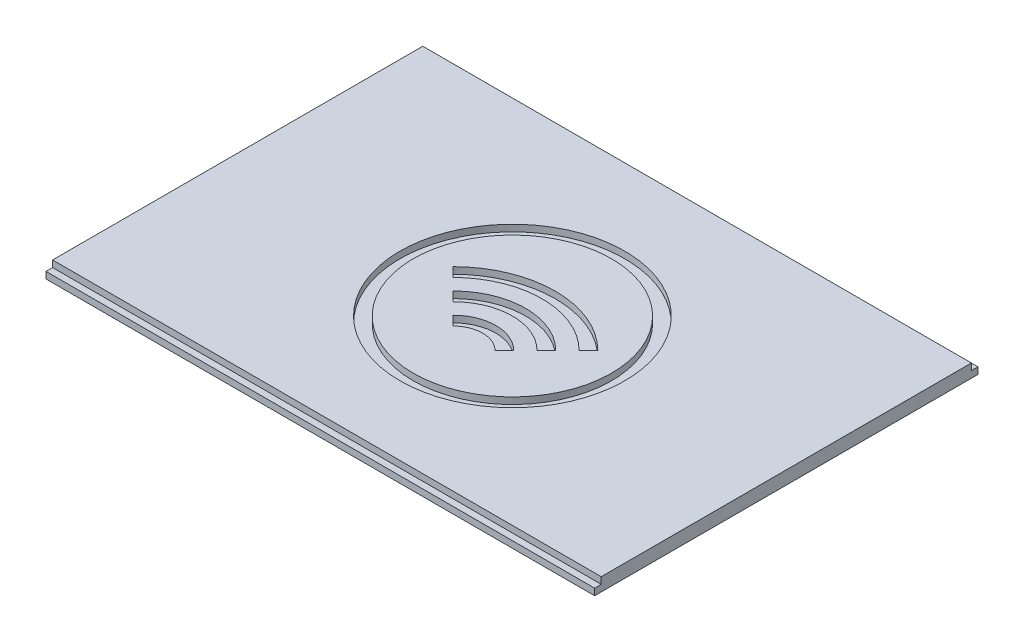
ISO-10303-21;
HEADER;
FILE_DESCRIPTION(('STEP AP214'),'2;1');
FILE_NAME('part.step','',(''),(''),'','','');
FILE_SCHEMA(('AUTOMOTIVE_DESIGN { 1 0 10303 214 1 1 1 1 }'));
ENDSEC;
DATA;
#1=APPLICATION_CONTEXT('core data for automotive mechanical design processes');
#2=APPLICATION_PROTOCOL_DEFINITION('international standard','automotive_design',2000,#1);
#3=PRODUCT_CONTEXT('',#1,'mechanical');
#4=PRODUCT('Part','Part','',(#3));
#5=PRODUCT_RELATED_PRODUCT_CATEGORY('part','',(#4));
#6=PRODUCT_DEFINITION_FORMATION('','',#4);
#7=PRODUCT_DEFINITION_CONTEXT('part definition',#1,'design');
#8=PRODUCT_DEFINITION('design','',#6,#7);
#9=PRODUCT_DEFINITION_SHAPE('','',#8);
#10=(LENGTH_UNIT() NAMED_UNIT(*) SI_UNIT(.MILLI.,.METRE.));
#11=(NAMED_UNIT(*) PLANE_ANGLE_UNIT() SI_UNIT($,.RADIAN.));
#12=(NAMED_UNIT(*) SI_UNIT($,.STERADIAN.) SOLID_ANGLE_UNIT());
#13=UNCERTAINTY_MEASURE_WITH_UNIT(LENGTH_MEASURE(1.E-05),#10,'distance_accuracy_value','');
#14=(GEOMETRIC_REPRESENTATION_CONTEXT(3) GLOBAL_UNCERTAINTY_ASSIGNED_CONTEXT((#13)) GLOBAL_UNIT_ASSIGNED_CONTEXT((#10,
#11,#12)) REPRESENTATION_CONTEXT('',''));
#15=CARTESIAN_POINT('',(0.,0.,0.));
#16=DIRECTION('',(0.,0.,1.));
#17=DIRECTION('',(1.,0.,0.));
#18=AXIS2_PLACEMENT_3D('',#15,#16,#17);
#19=CARTESIAN_POINT('',(0.,2.,0.));
#20=DIRECTION('',(0.,-1.,0.));
#21=DIRECTION('',(0.,0.,-1.));
#22=AXIS2_PLACEMENT_3D('',#19,#20,#21);
#23=PLANE('',#22);
#24=DIRECTION('',(-0.707106781186548,0.,-0.707106781186548));
#25=VECTOR('',#24,1.);
#26=CARTESIAN_POINT('',(30.7801669810002,2.,-30.7801669810002));
#27=LINE('',#26,#25);
#28=CARTESIAN_POINT('',(35.7558638216073,2.,-25.8044701403931));
#29=VERTEX_POINT('',#28);
#30=CARTESIAN_POINT('',(34.3416502592342,2.,-27.2186837027662));
#31=VERTEX_POINT('',#30);
#32=EDGE_CURVE('E149',#29,#31,#27,.T.);
#33=ORIENTED_EDGE('',*,*,#32,.T.);
#34=CARTESIAN_POINT('',(42.1198248522862,2.,-19.4405091097142));
#35=DIRECTION('',(0.,1.,0.));
#36=DIRECTION('',(0.,0.,1.));
#37=AXIS2_PLACEMENT_3D('',#34,#35,#36);
#38=CIRCLE('',#37,11.);
#39=CARTESIAN_POINT('',(49.8979994453382,2.,-27.2186837027662));
#40=VERTEX_POINT('',#39);
#41=EDGE_CURVE('E305',#31,#40,#38,.F.);
#42=ORIENTED_EDGE('',*,*,#41,.T.);
#43=DIRECTION('',(0.707106781186547,0.,-0.707106781186548));
#44=VECTOR('',#43,1.);
#45=CARTESIAN_POINT('',(11.3396578712861,2.,11.339657871286));
#46=LINE('',#45,#44);
#47=CARTESIAN_POINT('',(48.4837858829651,2.,-25.8044701403931));
#48=VERTEX_POINT('',#47);
#49=EDGE_CURVE('E318',#48,#40,#46,.T.);
#50=ORIENTED_EDGE('',*,*,#49,.F.);
#51=CARTESIAN_POINT('',(42.1198248522862,2.,-19.4405091097142));
#52=DIRECTION('',(0.,1.,0.));
#53=DIRECTION('',(0.,0.,1.));
#54=AXIS2_PLACEMENT_3D('',#51,#52,#53);
#55=CIRCLE('',#54,8.99999999999999);
#56=EDGE_CURVE('E315',#29,#48,#55,.F.);
#57=ORIENTED_EDGE('',*,*,#56,.F.);
#58=EDGE_LOOP('',(#33,#42,#50,#57));
#59=FACE_BOUND('',#58,.T.);
#60=CARTESIAN_POINT('',(42.1198248522862,2.,-28.4405091097142));
#61=DIRECTION('',(0.,1.,0.));
#62=DIRECTION('',(0.,0.,1.));
#63=AXIS2_PLACEMENT_3D('',#60,#61,#62);
#64=CIRCLE('',#63,15.);
#65=CARTESIAN_POINT('',(42.1198248522862,2.,-13.4405091097142));
#66=VERTEX_POINT('',#65);
#67=EDGE_CURVE('E355',#66,#66,#64,.T.);
#68=ORIENTED_EDGE('',*,*,#67,.T.);
#69=EDGE_LOOP('',(#68));
#70=FACE_BOUND('',#69,.T.);
#71=CARTESIAN_POINT('',(42.1198248522862,2.,-19.4405091097142));
#72=DIRECTION('',(0.,1.,0.));
#73=DIRECTION('',(0.,0.,1.));
#74=AXIS2_PLACEMENT_3D('',#71,#72,#73);
#75=CIRCLE('',#74,15.5);
#76=CARTESIAN_POINT('',(31.1596697438947,2.,-30.4006642181057));
#77=VERTEX_POINT('',#76);
#78=CARTESIAN_POINT('',(53.0799799606777,2.,-30.4006642181057));
#79=VERTEX_POINT('',#78);
#80=EDGE_CURVE('E325',#77,#79,#75,.F.);
#81=ORIENTED_EDGE('',*,*,#80,.T.);
#82=DIRECTION('',(0.707106781186548,0.,-0.707106781186548));
#83=VECTOR('',#82,1.);
#84=CARTESIAN_POINT('',(11.339657871286,2.,11.339657871286));
#85=LINE('',#84,#83);
#86=CARTESIAN_POINT('',(51.6657663983046,2.,-28.9864506557326));
#87=VERTEX_POINT('',#86);
#88=EDGE_CURVE('E334',#87,#79,#85,.T.);
#89=ORIENTED_EDGE('',*,*,#88,.F.);
#90=CARTESIAN_POINT('',(42.1198248522862,2.,-19.4405091097142));
#91=DIRECTION('',(0.,1.,0.));
#92=DIRECTION('',(0.,0.,1.));
#93=AXIS2_PLACEMENT_3D('',#90,#91,#92);
#94=CIRCLE('',#93,13.5);
#95=CARTESIAN_POINT('',(32.5738833062678,2.,-28.9864506557326));
#96=VERTEX_POINT('',#95);
#97=EDGE_CURVE('E348',#96,#87,#94,.F.);
#98=ORIENTED_EDGE('',*,*,#97,.F.);
#99=DIRECTION('',(-0.707106781186548,0.,-0.707106781186548));
#100=VECTOR('',#99,1.);
#101=CARTESIAN_POINT('',(30.7801669810002,2.,-30.7801669810002));
#102=LINE('',#101,#100);
#103=EDGE_CURVE('E345',#96,#77,#102,.T.);
#104=ORIENTED_EDGE('',*,*,#103,.T.);
#105=EDGE_LOOP('',(#81,#89,#98,#104));
#106=FACE_BOUND('',#105,.T.);
#107=DIRECTION('',(-0.707106781186548,0.,-0.707106781186548));
#108=VECTOR('',#107,1.);
#109=CARTESIAN_POINT('',(30.7801669810002,2.,-30.7801669810002));
#110=LINE('',#109,#108);
#111=CARTESIAN_POINT('',(38.9378443369467,2.,-22.6224896250536));
#112=VERTEX_POINT('',#111);
#113=CARTESIAN_POINT('',(37.5236307745736,2.,-24.0367031874267));
#114=VERTEX_POINT('',#113);
#115=EDGE_CURVE('E141',#112,#114,#110,.T.);
#116=ORIENTED_EDGE('',*,*,#115,.T.);
#117=CARTESIAN_POINT('',(42.1198248522862,2.,-19.4405091097142));
#118=DIRECTION('',(0.,1.,0.));
#119=DIRECTION('',(0.,0.,1.));
#120=AXIS2_PLACEMENT_3D('',#117,#118,#119);
#121=CIRCLE('',#120,6.5);
#122=CARTESIAN_POINT('',(46.7160189299987,2.,-24.0367031874267));
#123=VERTEX_POINT('',#122);
#124=EDGE_CURVE('E279',#114,#123,#121,.F.);
#125=ORIENTED_EDGE('',*,*,#124,.T.);
#126=DIRECTION('',(0.707106781186548,0.,-0.707106781186548));
#127=VECTOR('',#126,1.);
#128=CARTESIAN_POINT('',(11.339657871286,2.,11.339657871286));
#129=LINE('',#128,#127);
#130=CARTESIAN_POINT('',(45.3018053676257,2.,-22.6224896250537));
#131=VERTEX_POINT('',#130);
#132=EDGE_CURVE('E291',#131,#123,#129,.T.);
#133=ORIENTED_EDGE('',*,*,#132,.F.);
#134=CARTESIAN_POINT('',(42.1198248522862,2.,-19.4405091097142));
#135=DIRECTION('',(0.,1.,0.));
#136=DIRECTION('',(0.,0.,1.));
#137=AXIS2_PLACEMENT_3D('',#134,#135,#136);
#138=CIRCLE('',#137,4.5);
#139=EDGE_CURVE('E289',#112,#131,#138,.F.);
#140=ORIENTED_EDGE('',*,*,#139,.F.);
#141=EDGE_LOOP('',(#116,#125,#133,#140));
#142=FACE_BOUND('',#141,.T.);
#143=ADVANCED_FACE('F126',(#59,#70,#106,#142),#23,.F.);
#144=CARTESIAN_POINT('',(0.,2.,-58.));
#145=DIRECTION('',(0.,0.,1.));
#146=DIRECTION('',(1.,0.,0.));
#147=AXIS2_PLACEMENT_3D('',#144,#145,#146);
#148=PLANE('',#147);
#149=DIRECTION('',(-1.,0.,0.));
#150=VECTOR('',#149,1.);
#151=CARTESIAN_POINT('',(0.,1.,-58.));
#152=LINE('',#151,#150);
#153=CARTESIAN_POINT('',(83.,1.,-58.));
#154=VERTEX_POINT('',#153);
#155=CARTESIAN_POINT('',(0.,1.,-58.));
#156=VERTEX_POINT('',#155);
#157=EDGE_CURVE('E398',#154,#156,#152,.T.);
#158=ORIENTED_EDGE('',*,*,#157,.F.);
#159=DIRECTION('',(0.,-1.,0.));
#160=VECTOR('',#159,1.);
#161=CARTESIAN_POINT('',(83.,2.,-58.));
#162=LINE('',#161,#160);
#163=CARTESIAN_POINT('',(83.,0.,-58.));
#164=VERTEX_POINT('',#163);
#165=EDGE_CURVE('E426',#154,#164,#162,.T.);
#166=ORIENTED_EDGE('',*,*,#165,.T.);
#167=DIRECTION('',(-1.,0.,0.));
#168=VECTOR('',#167,1.);
#169=CARTESIAN_POINT('',(0.,0.,-58.));
#170=LINE('',#169,#168);
#171=CARTESIAN_POINT('',(0.,0.,-58.));
#172=VERTEX_POINT('',#171);
#173=EDGE_CURVE('E412',#164,#172,#170,.T.);
#174=ORIENTED_EDGE('',*,*,#173,.T.);
#175=DIRECTION('',(0.,-1.,0.));
#176=VECTOR('',#175,1.);
#177=CARTESIAN_POINT('',(0.,2.,-58.));
#178=LINE('',#177,#176);
#179=EDGE_CURVE('E414',#156,#172,#178,.T.);
#180=ORIENTED_EDGE('',*,*,#179,.F.);
#181=EDGE_LOOP('',(#158,#166,#174,#180));
#182=FACE_BOUND('',#181,.T.);
#183=ADVANCED_FACE('F447',(#182),#148,.F.);
#184=CARTESIAN_POINT('',(0.,2.,0.));
#185=DIRECTION('',(1.,0.,0.));
#186=DIRECTION('',(0.,0.,-1.));
#187=AXIS2_PLACEMENT_3D('',#184,#185,#186);
#188=PLANE('',#187);
#189=DIRECTION('',(0.,0.,1.));
#190=VECTOR('',#189,1.);
#191=CARTESIAN_POINT('',(0.,1.,0.));
#192=LINE('',#191,#190);
#193=CARTESIAN_POINT('',(0.,1.,-1.));
#194=VERTEX_POINT('',#193);
#195=CARTESIAN_POINT('',(0.,1.,0.));
#196=VERTEX_POINT('',#195);
#197=EDGE_CURVE('E374',#194,#196,#192,.T.);
#198=ORIENTED_EDGE('',*,*,#197,.F.);
#199=DIRECTION('',(0.,1.,0.));
#200=VECTOR('',#199,1.);
#201=CARTESIAN_POINT('',(0.,1.,-1.));
#202=LINE('',#201,#200);
#203=CARTESIAN_POINT('',(0.,2.,-1.));
#204=VERTEX_POINT('',#203);
#205=EDGE_CURVE('E385',#194,#204,#202,.T.);
#206=ORIENTED_EDGE('',*,*,#205,.T.);
#207=DIRECTION('',(0.,0.,1.));
#208=VECTOR('',#207,1.);
#209=CARTESIAN_POINT('',(0.,2.,0.));
#210=LINE('',#209,#208);
#211=CARTESIAN_POINT('',(0.,2.,-57.));
#212=VERTEX_POINT('',#211);
#213=EDGE_CURVE('E408',#212,#204,#210,.T.);
#214=ORIENTED_EDGE('',*,*,#213,.F.);
#215=DIRECTION('',(0.,1.,0.));
#216=VECTOR('',#215,1.);
#217=CARTESIAN_POINT('',(0.,1.,-57.));
#218=LINE('',#217,#216);
#219=CARTESIAN_POINT('',(0.,1.,-57.));
#220=VERTEX_POINT('',#219);
#221=EDGE_CURVE('E400',#220,#212,#218,.T.);
#222=ORIENTED_EDGE('',*,*,#221,.F.);
#223=DIRECTION('',(0.,0.,1.));
#224=VECTOR('',#223,1.);
#225=CARTESIAN_POINT('',(0.,1.,-58.));
#226=LINE('',#225,#224);
#227=EDGE_CURVE('E390',#156,#220,#226,.T.);
#228=ORIENTED_EDGE('',*,*,#227,.F.);
#229=ORIENTED_EDGE('',*,*,#179,.T.);
#230=DIRECTION('',(0.,0.,1.));
#231=VECTOR('',#230,1.);
#232=CARTESIAN_POINT('',(0.,0.,0.));
#233=LINE('',#232,#231);
#234=CARTESIAN_POINT('',(0.,0.,0.));
#235=VERTEX_POINT('',#234);
#236=EDGE_CURVE('E406',#172,#235,#233,.T.);
#237=ORIENTED_EDGE('',*,*,#236,.T.);
#238=DIRECTION('',(0.,-1.,0.));
#239=VECTOR('',#238,1.);
#240=CARTESIAN_POINT('',(0.,2.,0.));
#241=LINE('',#240,#239);
#242=EDGE_CURVE('E12',#196,#235,#241,.T.);
#243=ORIENTED_EDGE('',*,*,#242,.F.);
#244=EDGE_LOOP('',(#198,#206,#214,#222,#228,#229,#237,#243));
#245=FACE_BOUND('',#244,.T.);
#246=ADVANCED_FACE('F128',(#245),#188,.F.);
#247=CARTESIAN_POINT('',(0.,2.,0.));
#248=DIRECTION('',(0.,0.,-1.));
#249=DIRECTION('',(-1.,0.,0.));
#250=AXIS2_PLACEMENT_3D('',#247,#248,#249);
#251=PLANE('',#250);
#252=DIRECTION('',(0.,-1.,0.));
#253=VECTOR('',#252,1.);
#254=CARTESIAN_POINT('',(83.,2.,0.));
#255=LINE('',#254,#253);
#256=CARTESIAN_POINT('',(83.,1.,0.));
#257=VERTEX_POINT('',#256);
#258=CARTESIAN_POINT('',(83.,0.,0.));
#259=VERTEX_POINT('',#258);
#260=EDGE_CURVE('E134',#257,#259,#255,.T.);
#261=ORIENTED_EDGE('',*,*,#260,.F.);
#262=DIRECTION('',(1.,0.,0.));
#263=VECTOR('',#262,1.);
#264=CARTESIAN_POINT('',(0.,1.,0.));
#265=LINE('',#264,#263);
#266=EDGE_CURVE('E376',#196,#257,#265,.T.);
#267=ORIENTED_EDGE('',*,*,#266,.F.);
#268=ORIENTED_EDGE('',*,*,#242,.T.);
#269=DIRECTION('',(1.,0.,0.));
#270=VECTOR('',#269,1.);
#271=CARTESIAN_POINT('',(0.,0.,0.));
#272=LINE('',#271,#270);
#273=EDGE_CURVE('E417',#235,#259,#272,.T.);
#274=ORIENTED_EDGE('',*,*,#273,.T.);
#275=EDGE_LOOP('',(#261,#267,#268,#274));
#276=FACE_BOUND('',#275,.T.);
#277=ADVANCED_FACE('F439',(#276),#251,.F.);
#278=CARTESIAN_POINT('',(83.,2.,0.));
#279=DIRECTION('',(-1.,0.,0.));
#280=DIRECTION('',(0.,0.,1.));
#281=AXIS2_PLACEMENT_3D('',#278,#279,#280);
#282=PLANE('',#281);
#283=DIRECTION('',(0.,0.,-1.));
#284=VECTOR('',#283,1.);
#285=CARTESIAN_POINT('',(83.,2.,0.));
#286=LINE('',#285,#284);
#287=CARTESIAN_POINT('',(83.,2.,-1.));
#288=VERTEX_POINT('',#287);
#289=CARTESIAN_POINT('',(83.,2.,-57.));
#290=VERTEX_POINT('',#289);
#291=EDGE_CURVE('E411',#288,#290,#286,.T.);
#292=ORIENTED_EDGE('',*,*,#291,.F.);
#293=DIRECTION('',(0.,1.,0.));
#294=VECTOR('',#293,1.);
#295=CARTESIAN_POINT('',(83.,1.,-1.));
#296=LINE('',#295,#294);
#297=CARTESIAN_POINT('',(83.,1.,-1.));
#298=VERTEX_POINT('',#297);
#299=EDGE_CURVE('E383',#298,#288,#296,.T.);
#300=ORIENTED_EDGE('',*,*,#299,.F.);
#301=DIRECTION('',(0.,0.,-1.));
#302=VECTOR('',#301,1.);
#303=CARTESIAN_POINT('',(83.,1.,0.));
#304=LINE('',#303,#302);
#305=EDGE_CURVE('E378',#257,#298,#304,.T.);
#306=ORIENTED_EDGE('',*,*,#305,.F.);
#307=ORIENTED_EDGE('',*,*,#260,.T.);
#308=DIRECTION('',(0.,0.,-1.));
#309=VECTOR('',#308,1.);
#310=CARTESIAN_POINT('',(83.,0.,0.));
#311=LINE('',#310,#309);
#312=EDGE_CURVE('E420',#259,#164,#311,.T.);
#313=ORIENTED_EDGE('',*,*,#312,.T.);
#314=ORIENTED_EDGE('',*,*,#165,.F.);
#315=DIRECTION('',(0.,0.,-1.));
#316=VECTOR('',#315,1.);
#317=CARTESIAN_POINT('',(83.,1.,-58.));
#318=LINE('',#317,#316);
#319=CARTESIAN_POINT('',(83.,1.,-57.));
#320=VERTEX_POINT('',#319);
#321=EDGE_CURVE('E396',#320,#154,#318,.T.);
#322=ORIENTED_EDGE('',*,*,#321,.F.);
#323=DIRECTION('',(0.,1.,0.));
#324=VECTOR('',#323,1.);
#325=CARTESIAN_POINT('',(83.,1.,-57.));
#326=LINE('',#325,#324);
#327=EDGE_CURVE('E403',#320,#290,#326,.T.);
#328=ORIENTED_EDGE('',*,*,#327,.T.);
#329=EDGE_LOOP('',(#292,#300,#306,#307,#313,#314,#322,#328));
#330=FACE_BOUND('',#329,.T.);
#331=ADVANCED_FACE('F431',(#330),#282,.F.);
#332=CARTESIAN_POINT('',(42.1198248522862,2.,-28.4405091097142));
#333=DIRECTION('',(0.,1.,0.));
#334=DIRECTION('',(0.,0.,1.));
#335=AXIS2_PLACEMENT_3D('',#332,#333,#334);
#336=CIRCLE('',#335,17.);
#337=CARTESIAN_POINT('',(42.1198248522862,2.,-11.4405091097142));
#338=VERTEX_POINT('',#337);
#339=EDGE_CURVE('E366',#338,#338,#336,.T.);
#340=ORIENTED_EDGE('',*,*,#339,.F.);
#341=EDGE_LOOP('',(#340));
#342=FACE_BOUND('',#341,.T.);
#343=ORIENTED_EDGE('',*,*,#213,.T.);
#344=DIRECTION('',(-1.,0.,0.));
#345=VECTOR('',#344,1.);
#346=CARTESIAN_POINT('',(0.,2.,-1.));
#347=LINE('',#346,#345);
#348=EDGE_CURVE('E369',#288,#204,#347,.T.);
#349=ORIENTED_EDGE('',*,*,#348,.F.);
#350=ORIENTED_EDGE('',*,*,#291,.T.);
#351=DIRECTION('',(1.,0.,0.));
#352=VECTOR('',#351,1.);
#353=CARTESIAN_POINT('',(0.,2.,-57.));
#354=LINE('',#353,#352);
#355=EDGE_CURVE('E388',#212,#290,#354,.T.);
#356=ORIENTED_EDGE('',*,*,#355,.F.);
#357=EDGE_LOOP('',(#343,#349,#350,#356));
#358=FACE_BOUND('',#357,.T.);
#359=ADVANCED_FACE('F458',(#342,#358),#23,.F.);
#360=CARTESIAN_POINT('',(0.,0.,0.));
#361=DIRECTION('',(0.,-1.,0.));
#362=DIRECTION('',(0.,0.,-1.));
#363=AXIS2_PLACEMENT_3D('',#360,#361,#362);
#364=PLANE('',#363);
#365=ORIENTED_EDGE('',*,*,#236,.F.);
#366=ORIENTED_EDGE('',*,*,#173,.F.);
#367=ORIENTED_EDGE('',*,*,#312,.F.);
#368=ORIENTED_EDGE('',*,*,#273,.F.);
#369=EDGE_LOOP('',(#365,#366,#367,#368));
#370=FACE_BOUND('',#369,.T.);
#371=ADVANCED_FACE('F443',(#370),#364,.T.);
#372=CARTESIAN_POINT('',(0.,1.,-57.));
#373=DIRECTION('',(0.,0.,1.));
#374=DIRECTION('',(1.,0.,0.));
#375=AXIS2_PLACEMENT_3D('',#372,#373,#374);
#376=PLANE('',#375);
#377=ORIENTED_EDGE('',*,*,#355,.T.);
#378=ORIENTED_EDGE('',*,*,#327,.F.);
#379=DIRECTION('',(1.,0.,0.));
#380=VECTOR('',#379,1.);
#381=CARTESIAN_POINT('',(0.,1.,-57.));
#382=LINE('',#381,#380);
#383=EDGE_CURVE('E393',#220,#320,#382,.T.);
#384=ORIENTED_EDGE('',*,*,#383,.F.);
#385=ORIENTED_EDGE('',*,*,#221,.T.);
#386=EDGE_LOOP('',(#377,#378,#384,#385));
#387=FACE_BOUND('',#386,.T.);
#388=ADVANCED_FACE('F454',(#387),#376,.F.);
#389=CARTESIAN_POINT('',(0.,1.,0.));
#390=DIRECTION('',(0.,1.,0.));
#391=DIRECTION('',(0.,0.,1.));
#392=AXIS2_PLACEMENT_3D('',#389,#390,#391);
#393=PLANE('',#392);
#394=ORIENTED_EDGE('',*,*,#227,.T.);
#395=ORIENTED_EDGE('',*,*,#383,.T.);
#396=ORIENTED_EDGE('',*,*,#321,.T.);
#397=ORIENTED_EDGE('',*,*,#157,.T.);
#398=EDGE_LOOP('',(#394,#395,#396,#397));
#399=FACE_BOUND('',#398,.T.);
#400=ADVANCED_FACE('F450',(#399),#393,.T.);
#401=CARTESIAN_POINT('',(0.,1.,-1.));
#402=DIRECTION('',(0.,0.,-1.));
#403=DIRECTION('',(-1.,0.,0.));
#404=AXIS2_PLACEMENT_3D('',#401,#402,#403);
#405=PLANE('',#404);
#406=ORIENTED_EDGE('',*,*,#348,.T.);
#407=ORIENTED_EDGE('',*,*,#205,.F.);
#408=DIRECTION('',(-1.,0.,0.));
#409=VECTOR('',#408,1.);
#410=CARTESIAN_POINT('',(0.,1.,-1.));
#411=LINE('',#410,#409);
#412=EDGE_CURVE('E380',#298,#194,#411,.T.);
#413=ORIENTED_EDGE('',*,*,#412,.F.);
#414=ORIENTED_EDGE('',*,*,#299,.T.);
#415=EDGE_LOOP('',(#406,#407,#413,#414));
#416=FACE_BOUND('',#415,.T.);
#417=ADVANCED_FACE('F464',(#416),#405,.F.);
#418=CARTESIAN_POINT('',(0.,1.,0.));
#419=DIRECTION('',(0.,-1.,0.));
#420=DIRECTION('',(0.,0.,-1.));
#421=AXIS2_PLACEMENT_3D('',#418,#419,#420);
#422=PLANE('',#421);
#423=ORIENTED_EDGE('',*,*,#197,.T.);
#424=ORIENTED_EDGE('',*,*,#266,.T.);
#425=ORIENTED_EDGE('',*,*,#305,.T.);
#426=ORIENTED_EDGE('',*,*,#412,.T.);
#427=EDGE_LOOP('',(#423,#424,#425,#426));
#428=FACE_BOUND('',#427,.T.);
#429=ADVANCED_FACE('F466',(#428),#422,.F.);
#430=CARTESIAN_POINT('',(42.1198248522862,1.,-28.4405091097142));
#431=DIRECTION('',(0.,1.,0.));
#432=DIRECTION('',(0.,0.,1.));
#433=AXIS2_PLACEMENT_3D('',#430,#431,#432);
#434=CYLINDRICAL_SURFACE('',#433,15.);
#435=CARTESIAN_POINT('',(42.1198248522862,1.,-28.4405091097142));
#436=DIRECTION('',(0.,1.,0.));
#437=DIRECTION('',(0.,0.,1.));
#438=AXIS2_PLACEMENT_3D('',#435,#436,#437);
#439=CIRCLE('',#438,15.);
#440=CARTESIAN_POINT('',(42.1198248522862,1.,-13.4405091097142));
#441=VERTEX_POINT('',#440);
#442=EDGE_CURVE('E362',#441,#441,#439,.T.);
#443=ORIENTED_EDGE('',*,*,#442,.T.);
#444=EDGE_LOOP('',(#443));
#445=FACE_BOUND('',#444,.T.);
#446=ORIENTED_EDGE('',*,*,#67,.F.);
#447=EDGE_LOOP('',(#446));
#448=FACE_BOUND('',#447,.T.);
#449=ADVANCED_FACE('F468',(#445,#448),#434,.T.);
#450=CARTESIAN_POINT('',(42.1198248522862,1.,-28.4405091097142));
#451=DIRECTION('',(0.,1.,0.));
#452=DIRECTION('',(0.,0.,1.));
#453=AXIS2_PLACEMENT_3D('',#450,#451,#452);
#454=CYLINDRICAL_SURFACE('',#453,17.);
#455=CARTESIAN_POINT('',(42.1198248522862,1.,-28.4405091097142));
#456=DIRECTION('',(0.,1.,0.));
#457=DIRECTION('',(0.,0.,1.));
#458=AXIS2_PLACEMENT_3D('',#455,#456,#457);
#459=CIRCLE('',#458,17.);
#460=CARTESIAN_POINT('',(42.1198248522862,1.,-11.4405091097142));
#461=VERTEX_POINT('',#460);
#462=EDGE_CURVE('E365',#461,#461,#459,.T.);
#463=ORIENTED_EDGE('',*,*,#462,.F.);
#464=EDGE_LOOP('',(#463));
#465=FACE_BOUND('',#464,.T.);
#466=ORIENTED_EDGE('',*,*,#339,.T.);
#467=EDGE_LOOP('',(#466));
#468=FACE_BOUND('',#467,.T.);
#469=ADVANCED_FACE('F474',(#465,#468),#454,.F.);
#470=CARTESIAN_POINT('',(0.,1.,0.));
#471=DIRECTION('',(0.,1.,0.));
#472=DIRECTION('',(0.,0.,1.));
#473=AXIS2_PLACEMENT_3D('',#470,#471,#472);
#474=PLANE('',#473);
#475=ORIENTED_EDGE('',*,*,#442,.F.);
#476=EDGE_LOOP('',(#475));
#477=FACE_BOUND('',#476,.T.);
#478=ORIENTED_EDGE('',*,*,#462,.T.);
#479=EDGE_LOOP('',(#478));
#480=FACE_BOUND('',#479,.T.);
#481=ADVANCED_FACE('F498',(#477,#480),#474,.T.);
#482=CARTESIAN_POINT('',(42.1198248522862,1.,-19.4405091097142));
#483=DIRECTION('',(0.,1.,0.));
#484=DIRECTION('',(0.,0.,1.));
#485=AXIS2_PLACEMENT_3D('',#482,#483,#484);
#486=CYLINDRICAL_SURFACE('',#485,15.5);
#487=ORIENTED_EDGE('',*,*,#80,.F.);
#488=DIRECTION('',(0.,1.,0.));
#489=VECTOR('',#488,1.);
#490=CARTESIAN_POINT('',(31.1596697438947,1.,-30.4006642181057));
#491=LINE('',#490,#489);
#492=CARTESIAN_POINT('',(31.1596697438947,1.,-30.4006642181057));
#493=VERTEX_POINT('',#492);
#494=EDGE_CURVE('E342',#493,#77,#491,.T.);
#495=ORIENTED_EDGE('',*,*,#494,.F.);
#496=CARTESIAN_POINT('',(42.1198248522862,1.,-19.4405091097142));
#497=DIRECTION('',(0.,1.,0.));
#498=DIRECTION('',(0.,0.,1.));
#499=AXIS2_PLACEMENT_3D('',#496,#497,#498);
#500=CIRCLE('',#499,15.5);
#501=CARTESIAN_POINT('',(53.0799799606777,1.,-30.4006642181057));
#502=VERTEX_POINT('',#501);
#503=EDGE_CURVE('E331',#493,#502,#500,.F.);
#504=ORIENTED_EDGE('',*,*,#503,.T.);
#505=DIRECTION('',(0.,1.,0.));
#506=VECTOR('',#505,1.);
#507=CARTESIAN_POINT('',(53.0799799606777,1.,-30.4006642181057));
#508=LINE('',#507,#506);
#509=EDGE_CURVE('E353',#502,#79,#508,.T.);
#510=ORIENTED_EDGE('',*,*,#509,.T.);
#511=EDGE_LOOP('',(#487,#495,#504,#510));
#512=FACE_BOUND('',#511,.T.);
#513=ADVANCED_FACE('F504',(#512),#486,.F.);
#514=CARTESIAN_POINT('',(11.339657871286,1.,11.339657871286));
#515=DIRECTION('',(0.707106781186547,0.,0.707106781186547));
#516=DIRECTION('',(0.707106781186548,0.,-0.707106781186548));
#517=AXIS2_PLACEMENT_3D('',#514,#515,#516);
#518=PLANE('',#517);
#519=ORIENTED_EDGE('',*,*,#88,.T.);
#520=ORIENTED_EDGE('',*,*,#509,.F.);
#521=DIRECTION('',(0.707106781186548,0.,-0.707106781186548));
#522=VECTOR('',#521,1.);
#523=CARTESIAN_POINT('',(11.339657871286,1.,11.339657871286));
#524=LINE('',#523,#522);
#525=CARTESIAN_POINT('',(51.6657663983046,1.,-28.9864506557326));
#526=VERTEX_POINT('',#525);
#527=EDGE_CURVE('E339',#526,#502,#524,.T.);
#528=ORIENTED_EDGE('',*,*,#527,.F.);
#529=DIRECTION('',(0.,1.,0.));
#530=VECTOR('',#529,1.);
#531=CARTESIAN_POINT('',(51.6657663983046,1.,-28.9864506557326));
#532=LINE('',#531,#530);
#533=EDGE_CURVE('E356',#526,#87,#532,.T.);
#534=ORIENTED_EDGE('',*,*,#533,.T.);
#535=EDGE_LOOP('',(#519,#520,#528,#534));
#536=FACE_BOUND('',#535,.T.);
#537=ADVANCED_FACE('F511',(#536),#518,.F.);
#538=CARTESIAN_POINT('',(42.1198248522862,1.,-19.4405091097142));
#539=DIRECTION('',(0.,1.,0.));
#540=DIRECTION('',(0.,0.,1.));
#541=AXIS2_PLACEMENT_3D('',#538,#539,#540);
#542=CYLINDRICAL_SURFACE('',#541,13.5);
#543=ORIENTED_EDGE('',*,*,#97,.T.);
#544=ORIENTED_EDGE('',*,*,#533,.F.);
#545=CARTESIAN_POINT('',(42.1198248522862,1.,-19.4405091097142));
#546=DIRECTION('',(0.,1.,0.));
#547=DIRECTION('',(0.,0.,1.));
#548=AXIS2_PLACEMENT_3D('',#545,#546,#547);
#549=CIRCLE('',#548,13.5);
#550=CARTESIAN_POINT('',(32.5738833062678,1.,-28.9864506557326));
#551=VERTEX_POINT('',#550);
#552=EDGE_CURVE('E336',#551,#526,#549,.F.);
#553=ORIENTED_EDGE('',*,*,#552,.F.);
#554=DIRECTION('',(0.,1.,0.));
#555=VECTOR('',#554,1.);
#556=CARTESIAN_POINT('',(32.5738833062678,1.,-28.9864506557326));
#557=LINE('',#556,#555);
#558=EDGE_CURVE('E358',#551,#96,#557,.T.);
#559=ORIENTED_EDGE('',*,*,#558,.T.);
#560=EDGE_LOOP('',(#543,#544,#553,#559));
#561=FACE_BOUND('',#560,.T.);
#562=ADVANCED_FACE('F517',(#561),#542,.T.);
#563=CARTESIAN_POINT('',(30.7801669810002,1.,-30.7801669810002));
#564=DIRECTION('',(0.707106781186547,0.,-0.707106781186547));
#565=DIRECTION('',(-0.707106781186548,0.,-0.707106781186548));
#566=AXIS2_PLACEMENT_3D('',#563,#564,#565);
#567=PLANE('',#566);
#568=ORIENTED_EDGE('',*,*,#103,.F.);
#569=ORIENTED_EDGE('',*,*,#558,.F.);
#570=DIRECTION('',(-0.707106781186548,0.,-0.707106781186548));
#571=VECTOR('',#570,1.);
#572=CARTESIAN_POINT('',(30.7801669810002,1.,-30.7801669810002));
#573=LINE('',#572,#571);
#574=EDGE_CURVE('E333',#551,#493,#573,.T.);
#575=ORIENTED_EDGE('',*,*,#574,.T.);
#576=ORIENTED_EDGE('',*,*,#494,.T.);
#577=EDGE_LOOP('',(#568,#569,#575,#576));
#578=FACE_BOUND('',#577,.T.);
#579=ADVANCED_FACE('F513',(#578),#567,.T.);
#580=CARTESIAN_POINT('',(0.,1.,0.));
#581=DIRECTION('',(0.,1.,0.));
#582=DIRECTION('',(0.,0.,1.));
#583=AXIS2_PLACEMENT_3D('',#580,#581,#582);
#584=PLANE('',#583);
#585=ORIENTED_EDGE('',*,*,#503,.F.);
#586=ORIENTED_EDGE('',*,*,#574,.F.);
#587=ORIENTED_EDGE('',*,*,#552,.T.);
#588=ORIENTED_EDGE('',*,*,#527,.T.);
#589=EDGE_LOOP('',(#585,#586,#587,#588));
#590=FACE_BOUND('',#589,.T.);
#591=ADVANCED_FACE('F516',(#590),#584,.T.);
#592=CARTESIAN_POINT('',(30.7801669810002,1.,-30.7801669810002));
#593=DIRECTION('',(0.707106781186547,0.,-0.707106781186547));
#594=DIRECTION('',(-0.707106781186548,0.,-0.707106781186548));
#595=AXIS2_PLACEMENT_3D('',#592,#593,#594);
#596=PLANE('',#595);
#597=ORIENTED_EDGE('',*,*,#32,.F.);
#598=DIRECTION('',(0.,1.,0.));
#599=VECTOR('',#598,1.);
#600=CARTESIAN_POINT('',(35.7558638216073,1.,-25.8044701403931));
#601=LINE('',#600,#599);
#602=CARTESIAN_POINT('',(35.7558638216073,1.,-25.8044701403931));
#603=VERTEX_POINT('',#602);
#604=EDGE_CURVE('E313',#603,#29,#601,.T.);
#605=ORIENTED_EDGE('',*,*,#604,.F.);
#606=DIRECTION('',(-0.707106781186548,0.,-0.707106781186548));
#607=VECTOR('',#606,1.);
#608=CARTESIAN_POINT('',(30.7801669810002,1.,-30.7801669810002));
#609=LINE('',#608,#607);
#610=CARTESIAN_POINT('',(34.3416502592342,1.,-27.2186837027662));
#611=VERTEX_POINT('',#610);
#612=EDGE_CURVE('E301',#603,#611,#609,.T.);
#613=ORIENTED_EDGE('',*,*,#612,.T.);
#614=DIRECTION('',(0.,1.,0.));
#615=VECTOR('',#614,1.);
#616=CARTESIAN_POINT('',(34.3416502592342,1.,-27.2186837027662));
#617=LINE('',#616,#615);
#618=EDGE_CURVE('E323',#611,#31,#617,.T.);
#619=ORIENTED_EDGE('',*,*,#618,.T.);
#620=EDGE_LOOP('',(#597,#605,#613,#619));
#621=FACE_BOUND('',#620,.T.);
#622=ADVANCED_FACE('F527',(#621),#596,.T.);
#623=CARTESIAN_POINT('',(42.1198248522862,1.,-19.4405091097142));
#624=DIRECTION('',(0.,1.,0.));
#625=DIRECTION('',(0.,0.,1.));
#626=AXIS2_PLACEMENT_3D('',#623,#624,#625);
#627=CYLINDRICAL_SURFACE('',#626,11.);
#628=ORIENTED_EDGE('',*,*,#41,.F.);
#629=ORIENTED_EDGE('',*,*,#618,.F.);
#630=CARTESIAN_POINT('',(42.1198248522862,1.,-19.4405091097142));
#631=DIRECTION('',(0.,1.,0.));
#632=DIRECTION('',(0.,0.,1.));
#633=AXIS2_PLACEMENT_3D('',#630,#631,#632);
#634=CIRCLE('',#633,11.);
#635=CARTESIAN_POINT('',(49.8979994453382,1.,-27.2186837027662));
#636=VERTEX_POINT('',#635);
#637=EDGE_CURVE('E311',#611,#636,#634,.F.);
#638=ORIENTED_EDGE('',*,*,#637,.T.);
#639=DIRECTION('',(0.,1.,0.));
#640=VECTOR('',#639,1.);
#641=CARTESIAN_POINT('',(49.8979994453382,1.,-27.2186837027662));
#642=LINE('',#641,#640);
#643=EDGE_CURVE('E326',#636,#40,#642,.T.);
#644=ORIENTED_EDGE('',*,*,#643,.T.);
#645=EDGE_LOOP('',(#628,#629,#638,#644));
#646=FACE_BOUND('',#645,.T.);
#647=ADVANCED_FACE('F531',(#646),#627,.F.);
#648=CARTESIAN_POINT('',(11.3396578712861,1.,11.339657871286));
#649=DIRECTION('',(0.707106781186548,0.,0.707106781186547));
#650=DIRECTION('',(0.707106781186547,0.,-0.707106781186548));
#651=AXIS2_PLACEMENT_3D('',#648,#649,#650);
#652=PLANE('',#651);
#653=ORIENTED_EDGE('',*,*,#49,.T.);
#654=ORIENTED_EDGE('',*,*,#643,.F.);
#655=DIRECTION('',(0.707106781186547,0.,-0.707106781186548));
#656=VECTOR('',#655,1.);
#657=CARTESIAN_POINT('',(11.3396578712861,1.,11.339657871286));
#658=LINE('',#657,#656);
#659=CARTESIAN_POINT('',(48.4837858829651,1.,-25.8044701403931));
#660=VERTEX_POINT('',#659);
#661=EDGE_CURVE('E308',#660,#636,#658,.T.);
#662=ORIENTED_EDGE('',*,*,#661,.F.);
#663=DIRECTION('',(0.,1.,0.));
#664=VECTOR('',#663,1.);
#665=CARTESIAN_POINT('',(48.4837858829651,1.,-25.8044701403931));
#666=LINE('',#665,#664);
#667=EDGE_CURVE('E328',#660,#48,#666,.T.);
#668=ORIENTED_EDGE('',*,*,#667,.T.);
#669=EDGE_LOOP('',(#653,#654,#662,#668));
#670=FACE_BOUND('',#669,.T.);
#671=ADVANCED_FACE('F536',(#670),#652,.F.);
#672=CARTESIAN_POINT('',(42.1198248522862,1.,-19.4405091097142));
#673=DIRECTION('',(0.,1.,0.));
#674=DIRECTION('',(0.,0.,1.));
#675=AXIS2_PLACEMENT_3D('',#672,#673,#674);
#676=CYLINDRICAL_SURFACE('',#675,8.99999999999999);
#677=ORIENTED_EDGE('',*,*,#56,.T.);
#678=ORIENTED_EDGE('',*,*,#667,.F.);
#679=CARTESIAN_POINT('',(42.1198248522862,1.,-19.4405091097142));
#680=DIRECTION('',(0.,1.,0.));
#681=DIRECTION('',(0.,0.,1.));
#682=AXIS2_PLACEMENT_3D('',#679,#680,#681);
#683=CIRCLE('',#682,8.99999999999999);
#684=EDGE_CURVE('E304',#603,#660,#683,.F.);
#685=ORIENTED_EDGE('',*,*,#684,.F.);
#686=ORIENTED_EDGE('',*,*,#604,.T.);
#687=EDGE_LOOP('',(#677,#678,#685,#686));
#688=FACE_BOUND('',#687,.T.);
#689=ADVANCED_FACE('F532',(#688),#676,.T.);
#690=CARTESIAN_POINT('',(0.,1.,0.));
#691=DIRECTION('',(0.,1.,0.));
#692=DIRECTION('',(0.,0.,1.));
#693=AXIS2_PLACEMENT_3D('',#690,#691,#692);
#694=PLANE('',#693);
#695=ORIENTED_EDGE('',*,*,#612,.F.);
#696=ORIENTED_EDGE('',*,*,#684,.T.);
#697=ORIENTED_EDGE('',*,*,#661,.T.);
#698=ORIENTED_EDGE('',*,*,#637,.F.);
#699=EDGE_LOOP('',(#695,#696,#697,#698));
#700=FACE_BOUND('',#699,.T.);
#701=ADVANCED_FACE('F535',(#700),#694,.T.);
#702=CARTESIAN_POINT('',(30.7801669810002,1.,-30.7801669810002));
#703=DIRECTION('',(0.707106781186547,0.,-0.707106781186547));
#704=DIRECTION('',(-0.707106781186548,0.,-0.707106781186548));
#705=AXIS2_PLACEMENT_3D('',#702,#703,#704);
#706=PLANE('',#705);
#707=ORIENTED_EDGE('',*,*,#115,.F.);
#708=DIRECTION('',(0.,1.,0.));
#709=VECTOR('',#708,1.);
#710=CARTESIAN_POINT('',(38.9378443369467,1.,-22.6224896250536));
#711=LINE('',#710,#709);
#712=CARTESIAN_POINT('',(38.9378443369467,1.,-22.6224896250536));
#713=VERTEX_POINT('',#712);
#714=EDGE_CURVE('E262',#713,#112,#711,.T.);
#715=ORIENTED_EDGE('',*,*,#714,.F.);
#716=DIRECTION('',(-0.707106781186548,0.,-0.707106781186548));
#717=VECTOR('',#716,1.);
#718=CARTESIAN_POINT('',(30.7801669810002,1.,-30.7801669810002));
#719=LINE('',#718,#717);
#720=CARTESIAN_POINT('',(37.5236307745736,1.,-24.0367031874267));
#721=VERTEX_POINT('',#720);
#722=EDGE_CURVE('E265',#713,#721,#719,.T.);
#723=ORIENTED_EDGE('',*,*,#722,.T.);
#724=DIRECTION('',(0.,1.,0.));
#725=VECTOR('',#724,1.);
#726=CARTESIAN_POINT('',(37.5236307745736,1.,-24.0367031874267));
#727=LINE('',#726,#725);
#728=EDGE_CURVE('E296',#721,#114,#727,.T.);
#729=ORIENTED_EDGE('',*,*,#728,.T.);
#730=EDGE_LOOP('',(#707,#715,#723,#729));
#731=FACE_BOUND('',#730,.T.);
#732=ADVANCED_FACE('F264',(#731),#706,.T.);
#733=CARTESIAN_POINT('',(42.1198248522862,1.,-19.4405091097142));
#734=DIRECTION('',(0.,1.,0.));
#735=DIRECTION('',(0.,0.,1.));
#736=AXIS2_PLACEMENT_3D('',#733,#734,#735);
#737=CYLINDRICAL_SURFACE('',#736,6.5);
#738=ORIENTED_EDGE('',*,*,#124,.F.);
#739=ORIENTED_EDGE('',*,*,#728,.F.);
#740=CARTESIAN_POINT('',(42.1198248522862,1.,-19.4405091097142));
#741=DIRECTION('',(0.,1.,0.));
#742=DIRECTION('',(0.,0.,1.));
#743=AXIS2_PLACEMENT_3D('',#740,#741,#742);
#744=CIRCLE('',#743,6.5);
#745=CARTESIAN_POINT('',(46.7160189299987,1.,-24.0367031874267));
#746=VERTEX_POINT('',#745);
#747=EDGE_CURVE('E272',#721,#746,#744,.F.);
#748=ORIENTED_EDGE('',*,*,#747,.T.);
#749=DIRECTION('',(0.,1.,0.));
#750=VECTOR('',#749,1.);
#751=CARTESIAN_POINT('',(46.7160189299987,1.,-24.0367031874267));
#752=LINE('',#751,#750);
#753=EDGE_CURVE('E298',#746,#123,#752,.T.);
#754=ORIENTED_EDGE('',*,*,#753,.T.);
#755=EDGE_LOOP('',(#738,#739,#748,#754));
#756=FACE_BOUND('',#755,.T.);
#757=ADVANCED_FACE('F549',(#756),#737,.F.);
#758=CARTESIAN_POINT('',(11.339657871286,1.,11.339657871286));
#759=DIRECTION('',(0.707106781186547,0.,0.707106781186547));
#760=DIRECTION('',(0.707106781186548,0.,-0.707106781186548));
#761=AXIS2_PLACEMENT_3D('',#758,#759,#760);
#762=PLANE('',#761);
#763=ORIENTED_EDGE('',*,*,#132,.T.);
#764=ORIENTED_EDGE('',*,*,#753,.F.);
#765=DIRECTION('',(0.707106781186548,0.,-0.707106781186548));
#766=VECTOR('',#765,1.);
#767=CARTESIAN_POINT('',(11.339657871286,1.,11.339657871286));
#768=LINE('',#767,#766);
#769=CARTESIAN_POINT('',(45.3018053676257,1.,-22.6224896250537));
#770=VERTEX_POINT('',#769);
#771=EDGE_CURVE('E283',#770,#746,#768,.T.);
#772=ORIENTED_EDGE('',*,*,#771,.F.);
#773=DIRECTION('',(0.,1.,0.));
#774=VECTOR('',#773,1.);
#775=CARTESIAN_POINT('',(45.3018053676257,1.,-22.6224896250537));
#776=LINE('',#775,#774);
#777=EDGE_CURVE('E271',#770,#131,#776,.T.);
#778=ORIENTED_EDGE('',*,*,#777,.T.);
#779=EDGE_LOOP('',(#763,#764,#772,#778));
#780=FACE_BOUND('',#779,.T.);
#781=ADVANCED_FACE('F552',(#780),#762,.F.);
#782=CARTESIAN_POINT('',(42.1198248522862,1.,-19.4405091097142));
#783=DIRECTION('',(0.,1.,0.));
#784=DIRECTION('',(0.,0.,1.));
#785=AXIS2_PLACEMENT_3D('',#782,#783,#784);
#786=CYLINDRICAL_SURFACE('',#785,4.5);
#787=ORIENTED_EDGE('',*,*,#139,.T.);
#788=ORIENTED_EDGE('',*,*,#777,.F.);
#789=CARTESIAN_POINT('',(42.1198248522862,1.,-19.4405091097142));
#790=DIRECTION('',(0.,1.,0.));
#791=DIRECTION('',(0.,0.,1.));
#792=AXIS2_PLACEMENT_3D('',#789,#790,#791);
#793=CIRCLE('',#792,4.5);
#794=EDGE_CURVE('E278',#713,#770,#793,.F.);
#795=ORIENTED_EDGE('',*,*,#794,.F.);
#796=ORIENTED_EDGE('',*,*,#714,.T.);
#797=EDGE_LOOP('',(#787,#788,#795,#796));
#798=FACE_BOUND('',#797,.T.);
#799=ADVANCED_FACE('F281',(#798),#786,.T.);
#800=CARTESIAN_POINT('',(0.,1.,0.));
#801=DIRECTION('',(0.,1.,0.));
#802=DIRECTION('',(0.,0.,1.));
#803=AXIS2_PLACEMENT_3D('',#800,#801,#802);
#804=PLANE('',#803);
#805=ORIENTED_EDGE('',*,*,#722,.F.);
#806=ORIENTED_EDGE('',*,*,#794,.T.);
#807=ORIENTED_EDGE('',*,*,#771,.T.);
#808=ORIENTED_EDGE('',*,*,#747,.F.);
#809=EDGE_LOOP('',(#805,#806,#807,#808));
#810=FACE_BOUND('',#809,.T.);
#811=ADVANCED_FACE('F276',(#810),#804,.T.);
#812=CLOSED_SHELL('',(#143,#183,#246,#277,#331,#359,#371,#388,#400,#417,#429,#449,#469,#481,
#513,#537,#562,#579,#591,#622,#647,#671,#689,#701,#732,#757,#781,#799,#811));
#813=MANIFOLD_SOLID_BREP('B2',#812);
#814=ADVANCED_BREP_SHAPE_REPRESENTATION('',(#18,#813),#14);
#815=SHAPE_DEFINITION_REPRESENTATION(#9,#814);
ENDSEC;
END-ISO-10303-21;
